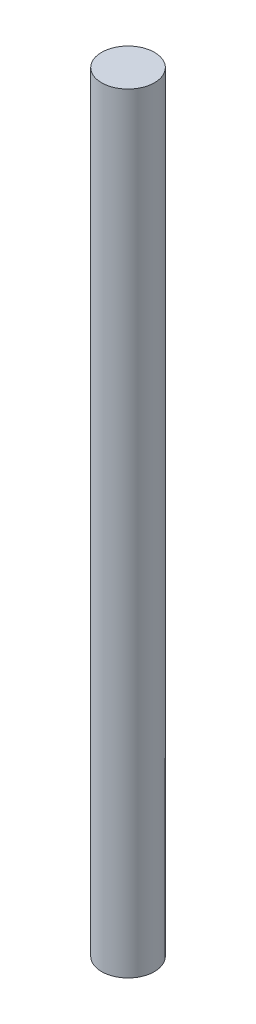
ISO-10303-21;
HEADER;
FILE_DESCRIPTION(('STEP AP214'),'2;1');
FILE_NAME('part.step','',(''),(''),'','','');
FILE_SCHEMA(('AUTOMOTIVE_DESIGN { 1 0 10303 214 1 1 1 1 }'));
ENDSEC;
DATA;
#1=APPLICATION_CONTEXT('core data for automotive mechanical design processes');
#2=APPLICATION_PROTOCOL_DEFINITION('international standard','automotive_design',2000,#1);
#3=PRODUCT_CONTEXT('',#1,'mechanical');
#4=PRODUCT('Part','Part','',(#3));
#5=PRODUCT_RELATED_PRODUCT_CATEGORY('part','',(#4));
#6=PRODUCT_DEFINITION_FORMATION('','',#4);
#7=PRODUCT_DEFINITION_CONTEXT('part definition',#1,'design');
#8=PRODUCT_DEFINITION('design','',#6,#7);
#9=PRODUCT_DEFINITION_SHAPE('','',#8);
#10=(LENGTH_UNIT() NAMED_UNIT(*) SI_UNIT(.MILLI.,.METRE.));
#11=(NAMED_UNIT(*) PLANE_ANGLE_UNIT() SI_UNIT($,.RADIAN.));
#12=(NAMED_UNIT(*) SI_UNIT($,.STERADIAN.) SOLID_ANGLE_UNIT());
#13=UNCERTAINTY_MEASURE_WITH_UNIT(LENGTH_MEASURE(1.E-05),#10,'distance_accuracy_value','');
#14=(GEOMETRIC_REPRESENTATION_CONTEXT(3) GLOBAL_UNCERTAINTY_ASSIGNED_CONTEXT((#13)) GLOBAL_UNIT_ASSIGNED_CONTEXT((#10,
#11,#12)) REPRESENTATION_CONTEXT('',''));
#15=CARTESIAN_POINT('',(0.,0.,0.));
#16=DIRECTION('',(0.,0.,1.));
#17=DIRECTION('',(1.,0.,0.));
#18=AXIS2_PLACEMENT_3D('',#15,#16,#17);
#19=CARTESIAN_POINT('',(0.,-1750.,0.));
#20=DIRECTION('',(0.,-1.,0.));
#21=DIRECTION('',(0.,0.,-1.));
#22=AXIS2_PLACEMENT_3D('',#19,#20,#21);
#23=CYLINDRICAL_SURFACE('',#22,60.);
#24=CARTESIAN_POINT('',(0.,-1750.,0.));
#25=DIRECTION('',(0.,-1.,0.));
#26=DIRECTION('',(0.,0.,-1.));
#27=AXIS2_PLACEMENT_3D('',#24,#25,#26);
#28=CIRCLE('',#27,60.);
#29=CARTESIAN_POINT('',(0.,-1750.,-60.));
#30=VERTEX_POINT('',#29);
#31=EDGE_CURVE('E10',#30,#30,#28,.T.);
#32=ORIENTED_EDGE('',*,*,#31,.F.);
#33=EDGE_LOOP('',(#32));
#34=FACE_BOUND('',#33,.T.);
#35=CARTESIAN_POINT('',(0.,0.,0.));
#36=DIRECTION('',(0.,-1.,0.));
#37=DIRECTION('',(0.,0.,-1.));
#38=AXIS2_PLACEMENT_3D('',#35,#36,#37);
#39=CIRCLE('',#38,60.);
#40=CARTESIAN_POINT('',(0.,0.,-60.));
#41=VERTEX_POINT('',#40);
#42=EDGE_CURVE('E37',#41,#41,#39,.T.);
#43=ORIENTED_EDGE('',*,*,#42,.T.);
#44=EDGE_LOOP('',(#43));
#45=FACE_BOUND('',#44,.T.);
#46=ADVANCED_FACE('F31',(#34,#45),#23,.T.);
#47=CARTESIAN_POINT('',(0.,-1750.,0.));
#48=DIRECTION('',(0.,-1.,0.));
#49=DIRECTION('',(0.,0.,-1.));
#50=AXIS2_PLACEMENT_3D('',#47,#48,#49);
#51=PLANE('',#50);
#52=ORIENTED_EDGE('',*,*,#31,.T.);
#53=EDGE_LOOP('',(#52));
#54=FACE_BOUND('',#53,.T.);
#55=ADVANCED_FACE('F46',(#54),#51,.T.);
#56=CARTESIAN_POINT('',(0.,0.,60.));
#57=DIRECTION('',(0.,1.,0.));
#58=DIRECTION('',(0.,0.,1.));
#59=AXIS2_PLACEMENT_3D('',#56,#57,#58);
#60=PLANE('',#59);
#61=ORIENTED_EDGE('',*,*,#42,.F.);
#62=EDGE_LOOP('',(#61));
#63=FACE_BOUND('',#62,.T.);
#64=ADVANCED_FACE('F44',(#63),#60,.T.);
#65=CLOSED_SHELL('',(#46,#55,#64));
#66=MANIFOLD_SOLID_BREP('B2',#65);
#67=ADVANCED_BREP_SHAPE_REPRESENTATION('',(#18,#66),#14);
#68=SHAPE_DEFINITION_REPRESENTATION(#9,#67);
ENDSEC;
END-ISO-10303-21;
